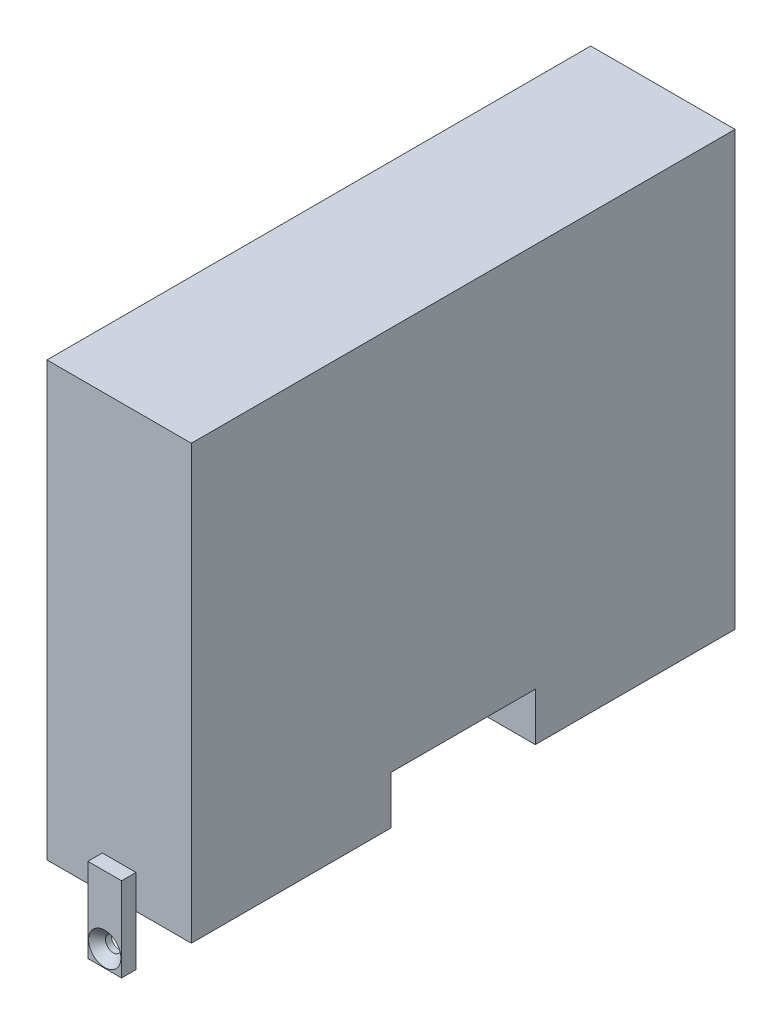
ISO-10303-21;
HEADER;
FILE_DESCRIPTION(('STEP AP214'),'2;1');
FILE_NAME('part.step','',(''),(''),'','','');
FILE_SCHEMA(('AUTOMOTIVE_DESIGN { 1 0 10303 214 1 1 1 1 }'));
ENDSEC;
DATA;
#1=APPLICATION_CONTEXT('core data for automotive mechanical design processes');
#2=APPLICATION_PROTOCOL_DEFINITION('international standard','automotive_design',2000,#1);
#3=PRODUCT_CONTEXT('',#1,'mechanical');
#4=PRODUCT('Part','Part','',(#3));
#5=PRODUCT_RELATED_PRODUCT_CATEGORY('part','',(#4));
#6=PRODUCT_DEFINITION_FORMATION('','',#4);
#7=PRODUCT_DEFINITION_CONTEXT('part definition',#1,'design');
#8=PRODUCT_DEFINITION('design','',#6,#7);
#9=PRODUCT_DEFINITION_SHAPE('','',#8);
#10=(LENGTH_UNIT() NAMED_UNIT(*) SI_UNIT(.MILLI.,.METRE.));
#11=(NAMED_UNIT(*) PLANE_ANGLE_UNIT() SI_UNIT($,.RADIAN.));
#12=(NAMED_UNIT(*) SI_UNIT($,.STERADIAN.) SOLID_ANGLE_UNIT());
#13=UNCERTAINTY_MEASURE_WITH_UNIT(LENGTH_MEASURE(1.E-05),#10,'distance_accuracy_value','');
#14=(GEOMETRIC_REPRESENTATION_CONTEXT(3) GLOBAL_UNCERTAINTY_ASSIGNED_CONTEXT((#13)) GLOBAL_UNIT_ASSIGNED_CONTEXT((#10,
#11,#12)) REPRESENTATION_CONTEXT('',''));
#15=CARTESIAN_POINT('',(0.,0.,0.));
#16=DIRECTION('',(0.,0.,1.));
#17=DIRECTION('',(1.,0.,0.));
#18=AXIS2_PLACEMENT_3D('',#15,#16,#17);
#19=CARTESIAN_POINT('',(15.,90.,56.5));
#20=DIRECTION('',(0.,0.,-1.));
#21=DIRECTION('',(-1.,0.,0.));
#22=AXIS2_PLACEMENT_3D('',#19,#20,#21);
#23=PLANE('',#22);
#24=DIRECTION('',(0.,-1.,0.));
#25=VECTOR('',#24,1.);
#26=CARTESIAN_POINT('',(-3.50000000000003,7.,56.5));
#27=LINE('',#26,#25);
#28=CARTESIAN_POINT('',(-3.50000000000003,7.,56.5));
#29=VERTEX_POINT('',#28);
#30=CARTESIAN_POINT('',(-3.50000000000003,0.,56.5));
#31=VERTEX_POINT('',#30);
#32=EDGE_CURVE('E51',#29,#31,#27,.T.);
#33=ORIENTED_EDGE('',*,*,#32,.F.);
#34=DIRECTION('',(-1.,0.,0.));
#35=VECTOR('',#34,1.);
#36=CARTESIAN_POINT('',(3.50000000000002,7.,56.5));
#37=LINE('',#36,#35);
#38=CARTESIAN_POINT('',(3.50000000000002,7.,56.5));
#39=VERTEX_POINT('',#38);
#40=EDGE_CURVE('E208',#39,#29,#37,.T.);
#41=ORIENTED_EDGE('',*,*,#40,.F.);
#42=DIRECTION('',(0.,1.,0.));
#43=VECTOR('',#42,1.);
#44=CARTESIAN_POINT('',(3.50000000000002,7.,56.5));
#45=LINE('',#44,#43);
#46=CARTESIAN_POINT('',(3.50000000000003,0.,56.5));
#47=VERTEX_POINT('',#46);
#48=EDGE_CURVE('E11',#47,#39,#45,.T.);
#49=ORIENTED_EDGE('',*,*,#48,.F.);
#50=DIRECTION('',(1.,0.,0.));
#51=VECTOR('',#50,1.);
#52=CARTESIAN_POINT('',(15.,0.,56.5));
#53=LINE('',#52,#51);
#54=CARTESIAN_POINT('',(15.,0.,56.5));
#55=VERTEX_POINT('',#54);
#56=EDGE_CURVE('E339',#47,#55,#53,.T.);
#57=ORIENTED_EDGE('',*,*,#56,.T.);
#58=DIRECTION('',(0.,-1.,0.));
#59=VECTOR('',#58,1.);
#60=CARTESIAN_POINT('',(15.,90.,56.5));
#61=LINE('',#60,#59);
#62=CARTESIAN_POINT('',(15.,90.,56.5));
#63=VERTEX_POINT('',#62);
#64=EDGE_CURVE('E356',#63,#55,#61,.T.);
#65=ORIENTED_EDGE('',*,*,#64,.F.);
#66=DIRECTION('',(1.,0.,0.));
#67=VECTOR('',#66,1.);
#68=CARTESIAN_POINT('',(15.,90.,56.5));
#69=LINE('',#68,#67);
#70=CARTESIAN_POINT('',(-15.,90.,56.5));
#71=VERTEX_POINT('',#70);
#72=EDGE_CURVE('E329',#71,#63,#69,.T.);
#73=ORIENTED_EDGE('',*,*,#72,.F.);
#74=DIRECTION('',(0.,-1.,0.));
#75=VECTOR('',#74,1.);
#76=CARTESIAN_POINT('',(-15.,90.,56.5));
#77=LINE('',#76,#75);
#78=CARTESIAN_POINT('',(-15.,0.,56.5));
#79=VERTEX_POINT('',#78);
#80=EDGE_CURVE('E359',#71,#79,#77,.T.);
#81=ORIENTED_EDGE('',*,*,#80,.T.);
#82=EDGE_CURVE('E340',#79,#31,#53,.T.);
#83=ORIENTED_EDGE('',*,*,#82,.T.);
#84=EDGE_LOOP('',(#33,#41,#49,#57,#65,#73,#81,#83));
#85=FACE_BOUND('',#84,.T.);
#86=ADVANCED_FACE('F33',(#85),#23,.F.);
#87=CARTESIAN_POINT('',(15.,90.,-56.5));
#88=DIRECTION('',(0.,0.,1.));
#89=DIRECTION('',(1.,0.,0.));
#90=AXIS2_PLACEMENT_3D('',#87,#88,#89);
#91=PLANE('',#90);
#92=DIRECTION('',(0.,-1.,0.));
#93=VECTOR('',#92,1.);
#94=CARTESIAN_POINT('',(3.49999999999997,6.75,-56.5));
#95=LINE('',#94,#93);
#96=CARTESIAN_POINT('',(3.49999999999997,6.75,-56.5));
#97=VERTEX_POINT('',#96);
#98=CARTESIAN_POINT('',(3.49999999999997,0.,-56.5));
#99=VERTEX_POINT('',#98);
#100=EDGE_CURVE('E237',#97,#99,#95,.T.);
#101=ORIENTED_EDGE('',*,*,#100,.F.);
#102=DIRECTION('',(1.,0.,0.));
#103=VECTOR('',#102,1.);
#104=CARTESIAN_POINT('',(-3.50000000000003,6.75,-56.5));
#105=LINE('',#104,#103);
#106=CARTESIAN_POINT('',(-3.50000000000003,6.75,-56.5));
#107=VERTEX_POINT('',#106);
#108=EDGE_CURVE('E230',#107,#97,#105,.T.);
#109=ORIENTED_EDGE('',*,*,#108,.F.);
#110=DIRECTION('',(0.,1.,0.));
#111=VECTOR('',#110,1.);
#112=CARTESIAN_POINT('',(-3.50000000000003,6.75,-56.5));
#113=LINE('',#112,#111);
#114=CARTESIAN_POINT('',(-3.50000000000003,0.,-56.5));
#115=VERTEX_POINT('',#114);
#116=EDGE_CURVE('E42',#115,#107,#113,.T.);
#117=ORIENTED_EDGE('',*,*,#116,.F.);
#118=DIRECTION('',(-1.,0.,0.));
#119=VECTOR('',#118,1.);
#120=CARTESIAN_POINT('',(15.,0.,-56.5));
#121=LINE('',#120,#119);
#122=CARTESIAN_POINT('',(-15.,0.,-56.5));
#123=VERTEX_POINT('',#122);
#124=EDGE_CURVE('E347',#115,#123,#121,.T.);
#125=ORIENTED_EDGE('',*,*,#124,.T.);
#126=DIRECTION('',(0.,-1.,0.));
#127=VECTOR('',#126,1.);
#128=CARTESIAN_POINT('',(-15.,90.,-56.5));
#129=LINE('',#128,#127);
#130=CARTESIAN_POINT('',(-15.,90.,-56.5));
#131=VERTEX_POINT('',#130);
#132=EDGE_CURVE('E336',#131,#123,#129,.T.);
#133=ORIENTED_EDGE('',*,*,#132,.F.);
#134=DIRECTION('',(-1.,0.,0.));
#135=VECTOR('',#134,1.);
#136=CARTESIAN_POINT('',(15.,90.,-56.5));
#137=LINE('',#136,#135);
#138=CARTESIAN_POINT('',(15.,90.,-56.5));
#139=VERTEX_POINT('',#138);
#140=EDGE_CURVE('E334',#139,#131,#137,.T.);
#141=ORIENTED_EDGE('',*,*,#140,.F.);
#142=DIRECTION('',(0.,-1.,0.));
#143=VECTOR('',#142,1.);
#144=CARTESIAN_POINT('',(15.,90.,-56.5));
#145=LINE('',#144,#143);
#146=CARTESIAN_POINT('',(15.,0.,-56.5));
#147=VERTEX_POINT('',#146);
#148=EDGE_CURVE('E353',#139,#147,#145,.T.);
#149=ORIENTED_EDGE('',*,*,#148,.T.);
#150=EDGE_CURVE('E330',#147,#99,#121,.T.);
#151=ORIENTED_EDGE('',*,*,#150,.T.);
#152=EDGE_LOOP('',(#101,#109,#117,#125,#133,#141,#149,#151));
#153=FACE_BOUND('',#152,.T.);
#154=ADVANCED_FACE('F398',(#153),#91,.F.);
#155=CARTESIAN_POINT('',(-15.,90.,-56.5));
#156=DIRECTION('',(1.,0.,0.));
#157=DIRECTION('',(0.,0.,-1.));
#158=AXIS2_PLACEMENT_3D('',#155,#156,#157);
#159=PLANE('',#158);
#160=DIRECTION('',(0.,-1.,0.));
#161=VECTOR('',#160,1.);
#162=CARTESIAN_POINT('',(-15.,90.,-47.5));
#163=LINE('',#162,#161);
#164=CARTESIAN_POINT('',(-15.,85.,-47.5));
#165=VERTEX_POINT('',#164);
#166=CARTESIAN_POINT('',(-15.,39.77,-47.5));
#167=VERTEX_POINT('',#166);
#168=EDGE_CURVE('E368',#165,#167,#163,.T.);
#169=ORIENTED_EDGE('',*,*,#168,.F.);
#170=DIRECTION('',(0.,0.,1.));
#171=VECTOR('',#170,1.);
#172=CARTESIAN_POINT('',(-15.,85.,-56.5));
#173=LINE('',#172,#171);
#174=CARTESIAN_POINT('',(-15.,85.,47.5));
#175=VERTEX_POINT('',#174);
#176=EDGE_CURVE('E370',#165,#175,#173,.T.);
#177=ORIENTED_EDGE('',*,*,#176,.T.);
#178=DIRECTION('',(0.,-1.,0.));
#179=VECTOR('',#178,1.);
#180=CARTESIAN_POINT('',(-15.,90.,47.5));
#181=LINE('',#180,#179);
#182=CARTESIAN_POINT('',(-15.,39.77,47.5));
#183=VERTEX_POINT('',#182);
#184=EDGE_CURVE('E362',#175,#183,#181,.T.);
#185=ORIENTED_EDGE('',*,*,#184,.T.);
#186=DIRECTION('',(0.,0.,1.));
#187=VECTOR('',#186,1.);
#188=CARTESIAN_POINT('',(-15.,39.77,-56.5));
#189=LINE('',#188,#187);
#190=EDGE_CURVE('E365',#167,#183,#189,.T.);
#191=ORIENTED_EDGE('',*,*,#190,.F.);
#192=EDGE_LOOP('',(#169,#177,#185,#191));
#193=FACE_BOUND('',#192,.T.);
#194=DIRECTION('',(0.,0.,1.));
#195=VECTOR('',#194,1.);
#196=CARTESIAN_POINT('',(-15.,0.,-56.5));
#197=LINE('',#196,#195);
#198=EDGE_CURVE('E320',#123,#79,#197,.T.);
#199=ORIENTED_EDGE('',*,*,#198,.T.);
#200=ORIENTED_EDGE('',*,*,#80,.F.);
#201=DIRECTION('',(0.,0.,1.));
#202=VECTOR('',#201,1.);
#203=CARTESIAN_POINT('',(-15.,90.,-56.5));
#204=LINE('',#203,#202);
#205=EDGE_CURVE('E326',#131,#71,#204,.T.);
#206=ORIENTED_EDGE('',*,*,#205,.F.);
#207=ORIENTED_EDGE('',*,*,#132,.T.);
#208=EDGE_LOOP('',(#199,#200,#206,#207));
#209=FACE_BOUND('',#208,.T.);
#210=ADVANCED_FACE('F35',(#193,#209),#159,.F.);
#211=CARTESIAN_POINT('',(15.,90.,-56.5));
#212=DIRECTION('',(-1.,0.,0.));
#213=DIRECTION('',(0.,0.,1.));
#214=AXIS2_PLACEMENT_3D('',#211,#212,#213);
#215=PLANE('',#214);
#216=DIRECTION('',(0.,0.,-1.));
#217=VECTOR('',#216,1.);
#218=CARTESIAN_POINT('',(15.,0.,-56.5));
#219=LINE('',#218,#217);
#220=CARTESIAN_POINT('',(15.,0.,15.));
#221=VERTEX_POINT('',#220);
#222=EDGE_CURVE('E344',#55,#221,#219,.T.);
#223=ORIENTED_EDGE('',*,*,#222,.T.);
#224=DIRECTION('',(0.,-1.,0.));
#225=VECTOR('',#224,1.);
#226=CARTESIAN_POINT('',(15.,0.,15.));
#227=LINE('',#226,#225);
#228=CARTESIAN_POINT('',(15.,10.,15.));
#229=VERTEX_POINT('',#228);
#230=EDGE_CURVE('E277',#229,#221,#227,.T.);
#231=ORIENTED_EDGE('',*,*,#230,.F.);
#232=DIRECTION('',(0.,0.,1.));
#233=VECTOR('',#232,1.);
#234=CARTESIAN_POINT('',(15.,10.,15.));
#235=LINE('',#234,#233);
#236=CARTESIAN_POINT('',(15.,10.,-15.));
#237=VERTEX_POINT('',#236);
#238=EDGE_CURVE('E281',#237,#229,#235,.T.);
#239=ORIENTED_EDGE('',*,*,#238,.F.);
#240=DIRECTION('',(0.,1.,0.));
#241=VECTOR('',#240,1.);
#242=CARTESIAN_POINT('',(15.,0.,-15.));
#243=LINE('',#242,#241);
#244=CARTESIAN_POINT('',(15.,0.,-15.));
#245=VERTEX_POINT('',#244);
#246=EDGE_CURVE('E292',#245,#237,#243,.T.);
#247=ORIENTED_EDGE('',*,*,#246,.F.);
#248=EDGE_CURVE('E342',#245,#147,#219,.T.);
#249=ORIENTED_EDGE('',*,*,#248,.T.);
#250=ORIENTED_EDGE('',*,*,#148,.F.);
#251=DIRECTION('',(0.,0.,-1.));
#252=VECTOR('',#251,1.);
#253=CARTESIAN_POINT('',(15.,90.,-56.5));
#254=LINE('',#253,#252);
#255=EDGE_CURVE('E332',#63,#139,#254,.T.);
#256=ORIENTED_EDGE('',*,*,#255,.F.);
#257=ORIENTED_EDGE('',*,*,#64,.T.);
#258=EDGE_LOOP('',(#223,#231,#239,#247,#249,#250,#256,#257));
#259=FACE_BOUND('',#258,.T.);
#260=ADVANCED_FACE('F416',(#259),#215,.F.);
#261=CARTESIAN_POINT('',(0.,90.,0.));
#262=DIRECTION('',(0.,-1.,0.));
#263=DIRECTION('',(0.,0.,-1.));
#264=AXIS2_PLACEMENT_3D('',#261,#262,#263);
#265=PLANE('',#264);
#266=ORIENTED_EDGE('',*,*,#205,.T.);
#267=ORIENTED_EDGE('',*,*,#72,.T.);
#268=ORIENTED_EDGE('',*,*,#255,.T.);
#269=ORIENTED_EDGE('',*,*,#140,.T.);
#270=EDGE_LOOP('',(#266,#267,#268,#269));
#271=FACE_BOUND('',#270,.T.);
#272=ADVANCED_FACE('F418',(#271),#265,.F.);
#273=CARTESIAN_POINT('',(0.,0.,0.));
#274=DIRECTION('',(0.,-1.,0.));
#275=DIRECTION('',(0.,0.,-1.));
#276=AXIS2_PLACEMENT_3D('',#273,#274,#275);
#277=PLANE('',#276);
#278=DIRECTION('',(1.,0.,0.));
#279=VECTOR('',#278,1.);
#280=CARTESIAN_POINT('',(5.,0.,15.));
#281=LINE('',#280,#279);
#282=CARTESIAN_POINT('',(5.,0.,15.));
#283=VERTEX_POINT('',#282);
#284=EDGE_CURVE('E290',#283,#221,#281,.T.);
#285=ORIENTED_EDGE('',*,*,#284,.T.);
#286=ORIENTED_EDGE('',*,*,#222,.F.);
#287=ORIENTED_EDGE('',*,*,#56,.F.);
#288=EDGE_CURVE('E343',#31,#47,#53,.T.);
#289=ORIENTED_EDGE('',*,*,#288,.F.);
#290=ORIENTED_EDGE('',*,*,#82,.F.);
#291=ORIENTED_EDGE('',*,*,#198,.F.);
#292=ORIENTED_EDGE('',*,*,#124,.F.);
#293=EDGE_CURVE('E350',#99,#115,#121,.T.);
#294=ORIENTED_EDGE('',*,*,#293,.F.);
#295=ORIENTED_EDGE('',*,*,#150,.F.);
#296=ORIENTED_EDGE('',*,*,#248,.F.);
#297=DIRECTION('',(1.,0.,0.));
#298=VECTOR('',#297,1.);
#299=CARTESIAN_POINT('',(5.,0.,-15.));
#300=LINE('',#299,#298);
#301=CARTESIAN_POINT('',(5.,0.,-15.));
#302=VERTEX_POINT('',#301);
#303=EDGE_CURVE('E302',#302,#245,#300,.T.);
#304=ORIENTED_EDGE('',*,*,#303,.F.);
#305=DIRECTION('',(0.,0.,-1.));
#306=VECTOR('',#305,1.);
#307=CARTESIAN_POINT('',(5.,0.,15.));
#308=LINE('',#307,#306);
#309=EDGE_CURVE('E280',#283,#302,#308,.T.);
#310=ORIENTED_EDGE('',*,*,#309,.F.);
#311=EDGE_LOOP('',(#285,#286,#287,#289,#290,#291,#292,#294,#295,#296,#304,#310));
#312=FACE_BOUND('',#311,.T.);
#313=ADVANCED_FACE('F421',(#312),#277,.T.);
#314=CARTESIAN_POINT('',(-90.,85.,-47.5));
#315=DIRECTION('',(0.,1.,0.));
#316=DIRECTION('',(0.,0.,1.));
#317=AXIS2_PLACEMENT_3D('',#314,#315,#316);
#318=PLANE('',#317);
#319=DIRECTION('',(1.,0.,0.));
#320=VECTOR('',#319,1.);
#321=CARTESIAN_POINT('',(-90.,85.,-47.5));
#322=LINE('',#321,#320);
#323=CARTESIAN_POINT('',(0.,85.,-47.5));
#324=VERTEX_POINT('',#323);
#325=EDGE_CURVE('E318',#165,#324,#322,.T.);
#326=ORIENTED_EDGE('',*,*,#325,.T.);
#327=DIRECTION('',(0.,0.,1.));
#328=VECTOR('',#327,1.);
#329=CARTESIAN_POINT('',(0.,85.,-47.5));
#330=LINE('',#329,#328);
#331=CARTESIAN_POINT('',(0.,85.,47.5));
#332=VERTEX_POINT('',#331);
#333=EDGE_CURVE('E299',#324,#332,#330,.T.);
#334=ORIENTED_EDGE('',*,*,#333,.T.);
#335=DIRECTION('',(1.,0.,0.));
#336=VECTOR('',#335,1.);
#337=CARTESIAN_POINT('',(-90.,85.,47.5));
#338=LINE('',#337,#336);
#339=EDGE_CURVE('E317',#175,#332,#338,.T.);
#340=ORIENTED_EDGE('',*,*,#339,.F.);
#341=ORIENTED_EDGE('',*,*,#176,.F.);
#342=EDGE_LOOP('',(#326,#334,#340,#341));
#343=FACE_BOUND('',#342,.T.);
#344=ADVANCED_FACE('F424',(#343),#318,.F.);
#345=CARTESIAN_POINT('',(-90.,85.,-47.5));
#346=DIRECTION('',(0.,0.,1.));
#347=DIRECTION('',(0.,-1.,0.));
#348=AXIS2_PLACEMENT_3D('',#345,#346,#347);
#349=PLANE('',#348);
#350=ORIENTED_EDGE('',*,*,#168,.T.);
#351=DIRECTION('',(1.,0.,0.));
#352=VECTOR('',#351,1.);
#353=CARTESIAN_POINT('',(-90.,39.77,-47.5));
#354=LINE('',#353,#352);
#355=CARTESIAN_POINT('',(0.,39.77,-47.5));
#356=VERTEX_POINT('',#355);
#357=EDGE_CURVE('E321',#167,#356,#354,.T.);
#358=ORIENTED_EDGE('',*,*,#357,.T.);
#359=DIRECTION('',(0.,-1.,0.));
#360=VECTOR('',#359,1.);
#361=CARTESIAN_POINT('',(0.,85.,-47.5));
#362=LINE('',#361,#360);
#363=EDGE_CURVE('E314',#324,#356,#362,.T.);
#364=ORIENTED_EDGE('',*,*,#363,.F.);
#365=ORIENTED_EDGE('',*,*,#325,.F.);
#366=EDGE_LOOP('',(#350,#358,#364,#365));
#367=FACE_BOUND('',#366,.T.);
#368=ADVANCED_FACE('F431',(#367),#349,.T.);
#369=CARTESIAN_POINT('',(-90.,39.77,-47.5));
#370=DIRECTION('',(0.,1.,0.));
#371=DIRECTION('',(0.,0.,1.));
#372=AXIS2_PLACEMENT_3D('',#369,#370,#371);
#373=PLANE('',#372);
#374=CARTESIAN_POINT('',(-8.50000000000001,39.77,-23.38));
#375=DIRECTION('',(0.,1.,0.));
#376=DIRECTION('',(0.,0.,1.));
#377=AXIS2_PLACEMENT_3D('',#374,#375,#376);
#378=CIRCLE('',#377,2.525);
#379=CARTESIAN_POINT('',(-8.50000000000001,39.77,-20.855));
#380=VERTEX_POINT('',#379);
#381=EDGE_CURVE('E259',#380,#380,#378,.T.);
#382=ORIENTED_EDGE('',*,*,#381,.F.);
#383=EDGE_LOOP('',(#382));
#384=FACE_BOUND('',#383,.T.);
#385=CARTESIAN_POINT('',(-8.50000000000002,39.77,18.62));
#386=DIRECTION('',(0.,1.,0.));
#387=DIRECTION('',(0.,0.,1.));
#388=AXIS2_PLACEMENT_3D('',#385,#386,#387);
#389=CIRCLE('',#388,2.525);
#390=CARTESIAN_POINT('',(-8.50000000000002,39.77,21.145));
#391=VERTEX_POINT('',#390);
#392=EDGE_CURVE('E268',#391,#391,#389,.T.);
#393=ORIENTED_EDGE('',*,*,#392,.F.);
#394=EDGE_LOOP('',(#393));
#395=FACE_BOUND('',#394,.T.);
#396=ORIENTED_EDGE('',*,*,#190,.T.);
#397=DIRECTION('',(1.,0.,0.));
#398=VECTOR('',#397,1.);
#399=CARTESIAN_POINT('',(-90.,39.77,47.5));
#400=LINE('',#399,#398);
#401=CARTESIAN_POINT('',(0.,39.77,47.5));
#402=VERTEX_POINT('',#401);
#403=EDGE_CURVE('E323',#183,#402,#400,.T.);
#404=ORIENTED_EDGE('',*,*,#403,.T.);
#405=DIRECTION('',(0.,0.,1.));
#406=VECTOR('',#405,1.);
#407=CARTESIAN_POINT('',(0.,39.77,-47.5));
#408=LINE('',#407,#406);
#409=EDGE_CURVE('E311',#356,#402,#408,.T.);
#410=ORIENTED_EDGE('',*,*,#409,.F.);
#411=ORIENTED_EDGE('',*,*,#357,.F.);
#412=EDGE_LOOP('',(#396,#404,#410,#411));
#413=FACE_BOUND('',#412,.T.);
#414=ADVANCED_FACE('F437',(#384,#395,#413),#373,.T.);
#415=CARTESIAN_POINT('',(-90.,85.,47.5));
#416=DIRECTION('',(0.,0.,1.));
#417=DIRECTION('',(0.,-1.,0.));
#418=AXIS2_PLACEMENT_3D('',#415,#416,#417);
#419=PLANE('',#418);
#420=ORIENTED_EDGE('',*,*,#339,.T.);
#421=DIRECTION('',(0.,-1.,0.));
#422=VECTOR('',#421,1.);
#423=CARTESIAN_POINT('',(0.,85.,47.5));
#424=LINE('',#423,#422);
#425=EDGE_CURVE('E308',#332,#402,#424,.T.);
#426=ORIENTED_EDGE('',*,*,#425,.T.);
#427=ORIENTED_EDGE('',*,*,#403,.F.);
#428=ORIENTED_EDGE('',*,*,#184,.F.);
#429=EDGE_LOOP('',(#420,#426,#427,#428));
#430=FACE_BOUND('',#429,.T.);
#431=ADVANCED_FACE('F433',(#430),#419,.F.);
#432=CARTESIAN_POINT('',(0.,0.,0.));
#433=DIRECTION('',(1.,0.,0.));
#434=DIRECTION('',(0.,0.,-1.));
#435=AXIS2_PLACEMENT_3D('',#432,#433,#434);
#436=PLANE('',#435);
#437=ORIENTED_EDGE('',*,*,#333,.F.);
#438=ORIENTED_EDGE('',*,*,#363,.T.);
#439=ORIENTED_EDGE('',*,*,#409,.T.);
#440=ORIENTED_EDGE('',*,*,#425,.F.);
#441=EDGE_LOOP('',(#437,#438,#439,#440));
#442=FACE_BOUND('',#441,.T.);
#443=ADVANCED_FACE('F436',(#442),#436,.F.);
#444=CARTESIAN_POINT('',(5.,0.,15.));
#445=DIRECTION('',(0.,0.,1.));
#446=DIRECTION('',(1.,0.,0.));
#447=AXIS2_PLACEMENT_3D('',#444,#445,#446);
#448=PLANE('',#447);
#449=ORIENTED_EDGE('',*,*,#230,.T.);
#450=ORIENTED_EDGE('',*,*,#284,.F.);
#451=DIRECTION('',(0.,-1.,0.));
#452=VECTOR('',#451,1.);
#453=CARTESIAN_POINT('',(5.,0.,15.));
#454=LINE('',#453,#452);
#455=CARTESIAN_POINT('',(5.,10.,15.));
#456=VERTEX_POINT('',#455);
#457=EDGE_CURVE('E278',#456,#283,#454,.T.);
#458=ORIENTED_EDGE('',*,*,#457,.F.);
#459=DIRECTION('',(1.,0.,0.));
#460=VECTOR('',#459,1.);
#461=CARTESIAN_POINT('',(5.,10.,15.));
#462=LINE('',#461,#460);
#463=EDGE_CURVE('E297',#456,#229,#462,.T.);
#464=ORIENTED_EDGE('',*,*,#463,.T.);
#465=EDGE_LOOP('',(#449,#450,#458,#464));
#466=FACE_BOUND('',#465,.T.);
#467=ADVANCED_FACE('F447',(#466),#448,.F.);
#468=CARTESIAN_POINT('',(5.,10.,15.));
#469=DIRECTION('',(0.,1.,0.));
#470=DIRECTION('',(0.,0.,1.));
#471=AXIS2_PLACEMENT_3D('',#468,#469,#470);
#472=PLANE('',#471);
#473=ORIENTED_EDGE('',*,*,#238,.T.);
#474=ORIENTED_EDGE('',*,*,#463,.F.);
#475=DIRECTION('',(0.,0.,1.));
#476=VECTOR('',#475,1.);
#477=CARTESIAN_POINT('',(5.,10.,15.));
#478=LINE('',#477,#476);
#479=CARTESIAN_POINT('',(5.,10.,-15.));
#480=VERTEX_POINT('',#479);
#481=EDGE_CURVE('E287',#480,#456,#478,.T.);
#482=ORIENTED_EDGE('',*,*,#481,.F.);
#483=DIRECTION('',(1.,0.,0.));
#484=VECTOR('',#483,1.);
#485=CARTESIAN_POINT('',(5.,10.,-15.));
#486=LINE('',#485,#484);
#487=EDGE_CURVE('E300',#480,#237,#486,.T.);
#488=ORIENTED_EDGE('',*,*,#487,.T.);
#489=EDGE_LOOP('',(#473,#474,#482,#488));
#490=FACE_BOUND('',#489,.T.);
#491=ADVANCED_FACE('F451',(#490),#472,.F.);
#492=CARTESIAN_POINT('',(5.,0.,-15.));
#493=DIRECTION('',(0.,0.,-1.));
#494=DIRECTION('',(-1.,0.,0.));
#495=AXIS2_PLACEMENT_3D('',#492,#493,#494);
#496=PLANE('',#495);
#497=ORIENTED_EDGE('',*,*,#246,.T.);
#498=ORIENTED_EDGE('',*,*,#487,.F.);
#499=DIRECTION('',(0.,1.,0.));
#500=VECTOR('',#499,1.);
#501=CARTESIAN_POINT('',(5.,0.,-15.));
#502=LINE('',#501,#500);
#503=EDGE_CURVE('E284',#302,#480,#502,.T.);
#504=ORIENTED_EDGE('',*,*,#503,.F.);
#505=ORIENTED_EDGE('',*,*,#303,.T.);
#506=EDGE_LOOP('',(#497,#498,#504,#505));
#507=FACE_BOUND('',#506,.T.);
#508=ADVANCED_FACE('F453',(#507),#496,.F.);
#509=CARTESIAN_POINT('',(5.,0.,0.));
#510=DIRECTION('',(-1.,0.,0.));
#511=DIRECTION('',(0.,0.,1.));
#512=AXIS2_PLACEMENT_3D('',#509,#510,#511);
#513=PLANE('',#512);
#514=ORIENTED_EDGE('',*,*,#457,.T.);
#515=ORIENTED_EDGE('',*,*,#309,.T.);
#516=ORIENTED_EDGE('',*,*,#503,.T.);
#517=ORIENTED_EDGE('',*,*,#481,.T.);
#518=EDGE_LOOP('',(#514,#515,#516,#517));
#519=FACE_BOUND('',#518,.T.);
#520=ADVANCED_FACE('F456',(#519),#513,.F.);
#521=CARTESIAN_POINT('',(-8.50000000000002,33.2721515475689,18.62));
#522=DIRECTION('',(0.,1.,0.));
#523=DIRECTION('',(0.,0.,1.));
#524=AXIS2_PLACEMENT_3D('',#521,#522,#523);
#525=CONICAL_SURFACE('',#524,2.5,1.02974425867665);
#526=CARTESIAN_POINT('',(-8.50000000000002,31.77,18.62));
#527=VERTEX_POINT('',#526);
#528=VERTEX_LOOP('',#527);
#529=FACE_BOUND('',#528,.T.);
#530=CARTESIAN_POINT('',(-8.50000000000002,33.2721515475689,18.62));
#531=DIRECTION('',(0.,1.,0.));
#532=DIRECTION('',(0.,0.,1.));
#533=AXIS2_PLACEMENT_3D('',#530,#531,#532);
#534=CIRCLE('',#533,2.5);
#535=CARTESIAN_POINT('',(-8.50000000000002,33.2721515475689,21.12));
#536=VERTEX_POINT('',#535);
#537=EDGE_CURVE('E274',#536,#536,#534,.T.);
#538=ORIENTED_EDGE('',*,*,#537,.T.);
#539=EDGE_LOOP('',(#538));
#540=FACE_BOUND('',#539,.T.);
#541=ADVANCED_FACE('F463',(#529,#540),#525,.F.);
#542=CARTESIAN_POINT('',(-8.50000000000002,39.77,18.62));
#543=DIRECTION('',(0.,1.,0.));
#544=DIRECTION('',(0.,0.,1.));
#545=AXIS2_PLACEMENT_3D('',#542,#543,#544);
#546=CYLINDRICAL_SURFACE('',#545,2.5);
#547=ORIENTED_EDGE('',*,*,#537,.F.);
#548=EDGE_LOOP('',(#547));
#549=FACE_BOUND('',#548,.T.);
#550=CARTESIAN_POINT('',(-8.50000000000002,39.745,18.62));
#551=DIRECTION('',(0.,1.,0.));
#552=DIRECTION('',(0.,0.,1.));
#553=AXIS2_PLACEMENT_3D('',#550,#551,#552);
#554=CIRCLE('',#553,2.5);
#555=CARTESIAN_POINT('',(-8.50000000000002,39.745,21.12));
#556=VERTEX_POINT('',#555);
#557=EDGE_CURVE('E271',#556,#556,#554,.T.);
#558=ORIENTED_EDGE('',*,*,#557,.T.);
#559=EDGE_LOOP('',(#558));
#560=FACE_BOUND('',#559,.T.);
#561=ADVANCED_FACE('F467',(#549,#560),#546,.F.);
#562=CARTESIAN_POINT('',(-8.50000000000002,39.77,18.62));
#563=DIRECTION('',(0.,1.,0.));
#564=DIRECTION('',(0.,0.,1.));
#565=AXIS2_PLACEMENT_3D('',#562,#563,#564);
#566=CONICAL_SURFACE('',#565,2.525,0.785398163397362);
#567=ORIENTED_EDGE('',*,*,#557,.F.);
#568=EDGE_LOOP('',(#567));
#569=FACE_BOUND('',#568,.T.);
#570=ORIENTED_EDGE('',*,*,#392,.T.);
#571=EDGE_LOOP('',(#570));
#572=FACE_BOUND('',#571,.T.);
#573=ADVANCED_FACE('F471',(#569,#572),#566,.F.);
#574=CARTESIAN_POINT('',(-8.50000000000001,33.2721515475689,-23.38));
#575=DIRECTION('',(0.,1.,0.));
#576=DIRECTION('',(0.,0.,1.));
#577=AXIS2_PLACEMENT_3D('',#574,#575,#576);
#578=CONICAL_SURFACE('',#577,2.5,1.02974425867665);
#579=CARTESIAN_POINT('',(-8.50000000000001,31.77,-23.38));
#580=VERTEX_POINT('',#579);
#581=VERTEX_LOOP('',#580);
#582=FACE_BOUND('',#581,.T.);
#583=CARTESIAN_POINT('',(-8.50000000000001,33.2721515475689,-23.38));
#584=DIRECTION('',(0.,1.,0.));
#585=DIRECTION('',(0.,0.,1.));
#586=AXIS2_PLACEMENT_3D('',#583,#584,#585);
#587=CIRCLE('',#586,2.5);
#588=CARTESIAN_POINT('',(-8.50000000000001,33.2721515475689,-20.88));
#589=VERTEX_POINT('',#588);
#590=EDGE_CURVE('E265',#589,#589,#587,.T.);
#591=ORIENTED_EDGE('',*,*,#590,.T.);
#592=EDGE_LOOP('',(#591));
#593=FACE_BOUND('',#592,.T.);
#594=ADVANCED_FACE('F475',(#582,#593),#578,.F.);
#595=CARTESIAN_POINT('',(-8.50000000000001,39.77,-23.38));
#596=DIRECTION('',(0.,1.,0.));
#597=DIRECTION('',(0.,0.,1.));
#598=AXIS2_PLACEMENT_3D('',#595,#596,#597);
#599=CYLINDRICAL_SURFACE('',#598,2.5);
#600=ORIENTED_EDGE('',*,*,#590,.F.);
#601=EDGE_LOOP('',(#600));
#602=FACE_BOUND('',#601,.T.);
#603=CARTESIAN_POINT('',(-8.50000000000001,39.745,-23.38));
#604=DIRECTION('',(0.,1.,0.));
#605=DIRECTION('',(0.,0.,1.));
#606=AXIS2_PLACEMENT_3D('',#603,#604,#605);
#607=CIRCLE('',#606,2.5);
#608=CARTESIAN_POINT('',(-8.50000000000001,39.745,-20.88));
#609=VERTEX_POINT('',#608);
#610=EDGE_CURVE('E262',#609,#609,#607,.T.);
#611=ORIENTED_EDGE('',*,*,#610,.T.);
#612=EDGE_LOOP('',(#611));
#613=FACE_BOUND('',#612,.T.);
#614=ADVANCED_FACE('F479',(#602,#613),#599,.F.);
#615=CARTESIAN_POINT('',(-8.50000000000001,39.77,-23.38));
#616=DIRECTION('',(0.,1.,0.));
#617=DIRECTION('',(0.,0.,1.));
#618=AXIS2_PLACEMENT_3D('',#615,#616,#617);
#619=CONICAL_SURFACE('',#618,2.525,0.785398163397362);
#620=ORIENTED_EDGE('',*,*,#610,.F.);
#621=EDGE_LOOP('',(#620));
#622=FACE_BOUND('',#621,.T.);
#623=ORIENTED_EDGE('',*,*,#381,.T.);
#624=EDGE_LOOP('',(#623));
#625=FACE_BOUND('',#624,.T.);
#626=ADVANCED_FACE('F483',(#622,#625),#619,.F.);
#627=CARTESIAN_POINT('',(3.49999999999997,6.75,-59.5));
#628=DIRECTION('',(-1.,0.,0.));
#629=DIRECTION('',(0.,0.,1.));
#630=AXIS2_PLACEMENT_3D('',#627,#628,#629);
#631=PLANE('',#630);
#632=ORIENTED_EDGE('',*,*,#100,.T.);
#633=CARTESIAN_POINT('',(3.49999999999997,-10.75,-56.5));
#634=VERTEX_POINT('',#633);
#635=EDGE_CURVE('E241',#99,#634,#95,.T.);
#636=ORIENTED_EDGE('',*,*,#635,.T.);
#637=DIRECTION('',(0.,0.,1.));
#638=VECTOR('',#637,1.);
#639=CARTESIAN_POINT('',(3.49999999999997,-10.75,-59.5));
#640=LINE('',#639,#638);
#641=CARTESIAN_POINT('',(3.49999999999997,-10.75,-59.5));
#642=VERTEX_POINT('',#641);
#643=EDGE_CURVE('E256',#642,#634,#640,.T.);
#644=ORIENTED_EDGE('',*,*,#643,.F.);
#645=DIRECTION('',(0.,-1.,0.));
#646=VECTOR('',#645,1.);
#647=CARTESIAN_POINT('',(3.49999999999997,6.75,-59.5));
#648=LINE('',#647,#646);
#649=CARTESIAN_POINT('',(3.49999999999997,6.75,-59.5));
#650=VERTEX_POINT('',#649);
#651=EDGE_CURVE('E226',#650,#642,#648,.T.);
#652=ORIENTED_EDGE('',*,*,#651,.F.);
#653=DIRECTION('',(0.,0.,1.));
#654=VECTOR('',#653,1.);
#655=CARTESIAN_POINT('',(3.49999999999997,6.75,-59.5));
#656=LINE('',#655,#654);
#657=EDGE_CURVE('E236',#650,#97,#656,.T.);
#658=ORIENTED_EDGE('',*,*,#657,.T.);
#659=EDGE_LOOP('',(#632,#636,#644,#652,#658));
#660=FACE_BOUND('',#659,.T.);
#661=ADVANCED_FACE('F379',(#660),#631,.F.);
#662=CARTESIAN_POINT('',(-3.50000000000003,-10.75,-59.5));
#663=DIRECTION('',(0.,1.,0.));
#664=DIRECTION('',(-1.,0.,0.));
#665=AXIS2_PLACEMENT_3D('',#662,#663,#664);
#666=PLANE('',#665);
#667=DIRECTION('',(-1.,0.,0.));
#668=VECTOR('',#667,1.);
#669=CARTESIAN_POINT('',(-3.50000000000003,-10.75,-56.5));
#670=LINE('',#669,#668);
#671=CARTESIAN_POINT('',(-3.50000000000003,-10.75,-56.5));
#672=VERTEX_POINT('',#671);
#673=EDGE_CURVE('E240',#634,#672,#670,.T.);
#674=ORIENTED_EDGE('',*,*,#673,.T.);
#675=DIRECTION('',(0.,0.,1.));
#676=VECTOR('',#675,1.);
#677=CARTESIAN_POINT('',(-3.50000000000003,-10.75,-59.5));
#678=LINE('',#677,#676);
#679=CARTESIAN_POINT('',(-3.50000000000003,-10.75,-59.5));
#680=VERTEX_POINT('',#679);
#681=EDGE_CURVE('E253',#680,#672,#678,.T.);
#682=ORIENTED_EDGE('',*,*,#681,.F.);
#683=DIRECTION('',(-1.,0.,0.));
#684=VECTOR('',#683,1.);
#685=CARTESIAN_POINT('',(-3.50000000000003,-10.75,-59.5));
#686=LINE('',#685,#684);
#687=EDGE_CURVE('E229',#642,#680,#686,.T.);
#688=ORIENTED_EDGE('',*,*,#687,.F.);
#689=ORIENTED_EDGE('',*,*,#643,.T.);
#690=EDGE_LOOP('',(#674,#682,#688,#689));
#691=FACE_BOUND('',#690,.T.);
#692=ADVANCED_FACE('F387',(#691),#666,.F.);
#693=CARTESIAN_POINT('',(-3.50000000000003,6.75,-59.5));
#694=DIRECTION('',(1.,0.,0.));
#695=DIRECTION('',(0.,0.,-1.));
#696=AXIS2_PLACEMENT_3D('',#693,#694,#695);
#697=PLANE('',#696);
#698=EDGE_CURVE('E243',#672,#115,#113,.T.);
#699=ORIENTED_EDGE('',*,*,#698,.T.);
#700=ORIENTED_EDGE('',*,*,#116,.T.);
#701=DIRECTION('',(0.,0.,1.));
#702=VECTOR('',#701,1.);
#703=CARTESIAN_POINT('',(-3.50000000000003,6.75,-59.5));
#704=LINE('',#703,#702);
#705=CARTESIAN_POINT('',(-3.50000000000003,6.75,-59.5));
#706=VERTEX_POINT('',#705);
#707=EDGE_CURVE('E250',#706,#107,#704,.T.);
#708=ORIENTED_EDGE('',*,*,#707,.F.);
#709=DIRECTION('',(0.,1.,0.));
#710=VECTOR('',#709,1.);
#711=CARTESIAN_POINT('',(-3.50000000000003,6.75,-59.5));
#712=LINE('',#711,#710);
#713=EDGE_CURVE('E232',#680,#706,#712,.T.);
#714=ORIENTED_EDGE('',*,*,#713,.F.);
#715=ORIENTED_EDGE('',*,*,#681,.T.);
#716=EDGE_LOOP('',(#699,#700,#708,#714,#715));
#717=FACE_BOUND('',#716,.T.);
#718=ADVANCED_FACE('F401',(#717),#697,.F.);
#719=CARTESIAN_POINT('',(-3.50000000000003,6.75,-59.5));
#720=DIRECTION('',(0.,-1.,0.));
#721=DIRECTION('',(1.,0.,0.));
#722=AXIS2_PLACEMENT_3D('',#719,#720,#721);
#723=PLANE('',#722);
#724=ORIENTED_EDGE('',*,*,#108,.T.);
#725=ORIENTED_EDGE('',*,*,#657,.F.);
#726=DIRECTION('',(1.,0.,0.));
#727=VECTOR('',#726,1.);
#728=CARTESIAN_POINT('',(-3.50000000000003,6.75,-59.5));
#729=LINE('',#728,#727);
#730=EDGE_CURVE('E234',#706,#650,#729,.T.);
#731=ORIENTED_EDGE('',*,*,#730,.F.);
#732=ORIENTED_EDGE('',*,*,#707,.T.);
#733=EDGE_LOOP('',(#724,#725,#731,#732));
#734=FACE_BOUND('',#733,.T.);
#735=ADVANCED_FACE('F394',(#734),#723,.F.);
#736=CARTESIAN_POINT('',(0.,0.,-59.5));
#737=DIRECTION('',(0.,0.,1.));
#738=DIRECTION('',(1.,0.,0.));
#739=AXIS2_PLACEMENT_3D('',#736,#737,#738);
#740=PLANE('',#739);
#741=CARTESIAN_POINT('',(0.,-7.25,-59.5));
#742=DIRECTION('',(0.,0.,-1.));
#743=DIRECTION('',(-1.,0.,0.));
#744=AXIS2_PLACEMENT_3D('',#741,#742,#743);
#745=CIRCLE('',#744,3.36);
#746=CARTESIAN_POINT('',(-3.36000000000003,-7.25,-59.5));
#747=VERTEX_POINT('',#746);
#748=EDGE_CURVE('E214',#747,#747,#745,.T.);
#749=ORIENTED_EDGE('',*,*,#748,.F.);
#750=EDGE_LOOP('',(#749));
#751=FACE_BOUND('',#750,.T.);
#752=ORIENTED_EDGE('',*,*,#651,.T.);
#753=ORIENTED_EDGE('',*,*,#687,.T.);
#754=ORIENTED_EDGE('',*,*,#713,.T.);
#755=ORIENTED_EDGE('',*,*,#730,.T.);
#756=EDGE_LOOP('',(#752,#753,#754,#755));
#757=FACE_BOUND('',#756,.T.);
#758=ADVANCED_FACE('F390',(#751,#757),#740,.F.);
#759=CARTESIAN_POINT('',(0.,0.,-56.5));
#760=DIRECTION('',(0.,0.,1.));
#761=DIRECTION('',(1.,0.,0.));
#762=AXIS2_PLACEMENT_3D('',#759,#760,#761);
#763=PLANE('',#762);
#764=CARTESIAN_POINT('',(0.,-7.25,-56.5));
#765=DIRECTION('',(0.,0.,1.));
#766=DIRECTION('',(1.,0.,0.));
#767=AXIS2_PLACEMENT_3D('',#764,#765,#766);
#768=CIRCLE('',#767,1.6);
#769=CARTESIAN_POINT('',(1.59999999999997,-7.25,-56.5));
#770=VERTEX_POINT('',#769);
#771=EDGE_CURVE('E225',#770,#770,#768,.T.);
#772=ORIENTED_EDGE('',*,*,#771,.F.);
#773=EDGE_LOOP('',(#772));
#774=FACE_BOUND('',#773,.T.);
#775=ORIENTED_EDGE('',*,*,#635,.F.);
#776=ORIENTED_EDGE('',*,*,#293,.T.);
#777=ORIENTED_EDGE('',*,*,#698,.F.);
#778=ORIENTED_EDGE('',*,*,#673,.F.);
#779=EDGE_LOOP('',(#775,#776,#777,#778));
#780=FACE_BOUND('',#779,.T.);
#781=ADVANCED_FACE('F384',(#774,#780),#763,.T.);
#782=CARTESIAN_POINT('',(0.,-7.25,-59.5));
#783=DIRECTION('',(0.,0.,-1.));
#784=DIRECTION('',(-1.,0.,0.));
#785=AXIS2_PLACEMENT_3D('',#782,#783,#784);
#786=CYLINDRICAL_SURFACE('',#785,1.6);
#787=ORIENTED_EDGE('',*,*,#771,.T.);
#788=EDGE_LOOP('',(#787));
#789=FACE_BOUND('',#788,.T.);
#790=CARTESIAN_POINT('',(0.,-7.25,-57.74));
#791=DIRECTION('',(0.,0.,-1.));
#792=DIRECTION('',(-1.,0.,0.));
#793=AXIS2_PLACEMENT_3D('',#790,#791,#792);
#794=CIRCLE('',#793,1.6);
#795=CARTESIAN_POINT('',(-1.60000000000003,-7.25,-57.74));
#796=VERTEX_POINT('',#795);
#797=EDGE_CURVE('E217',#796,#796,#794,.T.);
#798=ORIENTED_EDGE('',*,*,#797,.T.);
#799=EDGE_LOOP('',(#798));
#800=FACE_BOUND('',#799,.T.);
#801=ADVANCED_FACE('F526',(#789,#800),#786,.F.);
#802=CARTESIAN_POINT('',(0.,-7.25,-59.5));
#803=DIRECTION('',(0.,0.,-1.));
#804=DIRECTION('',(-1.,0.,0.));
#805=AXIS2_PLACEMENT_3D('',#802,#803,#804);
#806=CONICAL_SURFACE('',#805,3.36,0.785398163397449);
#807=ORIENTED_EDGE('',*,*,#797,.F.);
#808=EDGE_LOOP('',(#807));
#809=FACE_BOUND('',#808,.T.);
#810=ORIENTED_EDGE('',*,*,#748,.T.);
#811=EDGE_LOOP('',(#810));
#812=FACE_BOUND('',#811,.T.);
#813=ADVANCED_FACE('F536',(#809,#812),#806,.F.);
#814=CARTESIAN_POINT('',(-3.50000000000003,7.,59.5));
#815=DIRECTION('',(1.,0.,0.));
#816=DIRECTION('',(0.,1.,0.));
#817=AXIS2_PLACEMENT_3D('',#814,#815,#816);
#818=PLANE('',#817);
#819=ORIENTED_EDGE('',*,*,#32,.T.);
#820=CARTESIAN_POINT('',(-3.50000000000003,-10.5,56.5));
#821=VERTEX_POINT('',#820);
#822=EDGE_CURVE('E212',#31,#821,#27,.T.);
#823=ORIENTED_EDGE('',*,*,#822,.T.);
#824=DIRECTION('',(0.,0.,-1.));
#825=VECTOR('',#824,1.);
#826=CARTESIAN_POINT('',(-3.50000000000003,-10.5,59.5));
#827=LINE('',#826,#825);
#828=CARTESIAN_POINT('',(-3.50000000000003,-10.5,59.5));
#829=VERTEX_POINT('',#828);
#830=EDGE_CURVE('E193',#829,#821,#827,.T.);
#831=ORIENTED_EDGE('',*,*,#830,.F.);
#832=DIRECTION('',(0.,-1.,0.));
#833=VECTOR('',#832,1.);
#834=CARTESIAN_POINT('',(-3.50000000000003,7.,59.5));
#835=LINE('',#834,#833);
#836=CARTESIAN_POINT('',(-3.50000000000003,7.,59.5));
#837=VERTEX_POINT('',#836);
#838=EDGE_CURVE('E199',#837,#829,#835,.T.);
#839=ORIENTED_EDGE('',*,*,#838,.F.);
#840=DIRECTION('',(0.,0.,-1.));
#841=VECTOR('',#840,1.);
#842=CARTESIAN_POINT('',(-3.50000000000003,7.,59.5));
#843=LINE('',#842,#841);
#844=EDGE_CURVE('E648',#837,#29,#843,.T.);
#845=ORIENTED_EDGE('',*,*,#844,.T.);
#846=EDGE_LOOP('',(#819,#823,#831,#839,#845));
#847=FACE_BOUND('',#846,.T.);
#848=ADVANCED_FACE('F210',(#847),#818,.F.);
#849=CARTESIAN_POINT('',(3.50000000000003,-10.5,59.5));
#850=DIRECTION('',(0.,1.,0.));
#851=DIRECTION('',(-1.,0.,0.));
#852=AXIS2_PLACEMENT_3D('',#849,#850,#851);
#853=PLANE('',#852);
#854=DIRECTION('',(1.,0.,0.));
#855=VECTOR('',#854,1.);
#856=CARTESIAN_POINT('',(3.50000000000003,-10.5,56.5));
#857=LINE('',#856,#855);
#858=CARTESIAN_POINT('',(3.50000000000003,-10.5,56.5));
#859=VERTEX_POINT('',#858);
#860=EDGE_CURVE('E650',#821,#859,#857,.T.);
#861=ORIENTED_EDGE('',*,*,#860,.T.);
#862=DIRECTION('',(0.,0.,-1.));
#863=VECTOR('',#862,1.);
#864=CARTESIAN_POINT('',(3.50000000000003,-10.5,59.5));
#865=LINE('',#864,#863);
#866=CARTESIAN_POINT('',(3.50000000000003,-10.5,59.5));
#867=VERTEX_POINT('',#866);
#868=EDGE_CURVE('E195',#867,#859,#865,.T.);
#869=ORIENTED_EDGE('',*,*,#868,.F.);
#870=DIRECTION('',(1.,0.,0.));
#871=VECTOR('',#870,1.);
#872=CARTESIAN_POINT('',(3.50000000000003,-10.5,59.5));
#873=LINE('',#872,#871);
#874=EDGE_CURVE('E189',#829,#867,#873,.T.);
#875=ORIENTED_EDGE('',*,*,#874,.F.);
#876=ORIENTED_EDGE('',*,*,#830,.T.);
#877=EDGE_LOOP('',(#861,#869,#875,#876));
#878=FACE_BOUND('',#877,.T.);
#879=ADVANCED_FACE('F191',(#878),#853,.F.);
#880=CARTESIAN_POINT('',(3.50000000000002,7.,59.5));
#881=DIRECTION('',(-1.,0.,0.));
#882=DIRECTION('',(0.,-1.,0.));
#883=AXIS2_PLACEMENT_3D('',#880,#881,#882);
#884=PLANE('',#883);
#885=EDGE_CURVE('E44',#859,#47,#45,.T.);
#886=ORIENTED_EDGE('',*,*,#885,.T.);
#887=ORIENTED_EDGE('',*,*,#48,.T.);
#888=DIRECTION('',(0.,0.,-1.));
#889=VECTOR('',#888,1.);
#890=CARTESIAN_POINT('',(3.50000000000002,7.,59.5));
#891=LINE('',#890,#889);
#892=CARTESIAN_POINT('',(3.50000000000002,7.,59.5));
#893=VERTEX_POINT('',#892);
#894=EDGE_CURVE('E219',#893,#39,#891,.T.);
#895=ORIENTED_EDGE('',*,*,#894,.F.);
#896=DIRECTION('',(0.,1.,0.));
#897=VECTOR('',#896,1.);
#898=CARTESIAN_POINT('',(3.50000000000002,7.,59.5));
#899=LINE('',#898,#897);
#900=EDGE_CURVE('E198',#867,#893,#899,.T.);
#901=ORIENTED_EDGE('',*,*,#900,.F.);
#902=ORIENTED_EDGE('',*,*,#868,.T.);
#903=EDGE_LOOP('',(#886,#887,#895,#901,#902));
#904=FACE_BOUND('',#903,.T.);
#905=ADVANCED_FACE('F574',(#904),#884,.F.);
#906=CARTESIAN_POINT('',(3.50000000000002,7.,59.5));
#907=DIRECTION('',(0.,-1.,0.));
#908=DIRECTION('',(1.,0.,0.));
#909=AXIS2_PLACEMENT_3D('',#906,#907,#908);
#910=PLANE('',#909);
#911=ORIENTED_EDGE('',*,*,#40,.T.);
#912=ORIENTED_EDGE('',*,*,#844,.F.);
#913=DIRECTION('',(-1.,0.,0.));
#914=VECTOR('',#913,1.);
#915=CARTESIAN_POINT('',(3.50000000000002,7.,59.5));
#916=LINE('',#915,#914);
#917=EDGE_CURVE('E204',#893,#837,#916,.T.);
#918=ORIENTED_EDGE('',*,*,#917,.F.);
#919=ORIENTED_EDGE('',*,*,#894,.T.);
#920=EDGE_LOOP('',(#911,#912,#918,#919));
#921=FACE_BOUND('',#920,.T.);
#922=ADVANCED_FACE('F583',(#921),#910,.F.);
#923=CARTESIAN_POINT('',(0.,0.,59.5));
#924=DIRECTION('',(0.,0.,-1.));
#925=DIRECTION('',(-1.,0.,0.));
#926=AXIS2_PLACEMENT_3D('',#923,#924,#925);
#927=PLANE('',#926);
#928=CARTESIAN_POINT('',(0.,-7.,59.5));
#929=DIRECTION('',(0.,0.,1.));
#930=DIRECTION('',(1.,0.,0.));
#931=AXIS2_PLACEMENT_3D('',#928,#929,#930);
#932=CIRCLE('',#931,3.36);
#933=CARTESIAN_POINT('',(3.36,-7.,59.5));
#934=VERTEX_POINT('',#933);
#935=EDGE_CURVE('E642',#934,#934,#932,.T.);
#936=ORIENTED_EDGE('',*,*,#935,.F.);
#937=EDGE_LOOP('',(#936));
#938=FACE_BOUND('',#937,.T.);
#939=ORIENTED_EDGE('',*,*,#838,.T.);
#940=ORIENTED_EDGE('',*,*,#874,.T.);
#941=ORIENTED_EDGE('',*,*,#900,.T.);
#942=ORIENTED_EDGE('',*,*,#917,.T.);
#943=EDGE_LOOP('',(#939,#940,#941,#942));
#944=FACE_BOUND('',#943,.T.);
#945=ADVANCED_FACE('F202',(#938,#944),#927,.F.);
#946=CARTESIAN_POINT('',(0.,0.,56.5));
#947=DIRECTION('',(0.,0.,-1.));
#948=DIRECTION('',(-1.,0.,0.));
#949=AXIS2_PLACEMENT_3D('',#946,#947,#948);
#950=PLANE('',#949);
#951=CARTESIAN_POINT('',(0.,-7.,56.5));
#952=DIRECTION('',(0.,0.,-1.));
#953=DIRECTION('',(-1.,0.,0.));
#954=AXIS2_PLACEMENT_3D('',#951,#952,#953);
#955=CIRCLE('',#954,1.59999999999999);
#956=CARTESIAN_POINT('',(-1.59999999999999,-7.,56.5));
#957=VERTEX_POINT('',#956);
#958=EDGE_CURVE('E37',#957,#957,#955,.T.);
#959=ORIENTED_EDGE('',*,*,#958,.F.);
#960=EDGE_LOOP('',(#959));
#961=FACE_BOUND('',#960,.T.);
#962=ORIENTED_EDGE('',*,*,#822,.F.);
#963=ORIENTED_EDGE('',*,*,#288,.T.);
#964=ORIENTED_EDGE('',*,*,#885,.F.);
#965=ORIENTED_EDGE('',*,*,#860,.F.);
#966=EDGE_LOOP('',(#962,#963,#964,#965));
#967=FACE_BOUND('',#966,.T.);
#968=ADVANCED_FACE('F602',(#961,#967),#950,.T.);
#969=CARTESIAN_POINT('',(0.,-7.,59.5));
#970=DIRECTION('',(0.,0.,1.));
#971=DIRECTION('',(1.,0.,0.));
#972=AXIS2_PLACEMENT_3D('',#969,#970,#971);
#973=CYLINDRICAL_SURFACE('',#972,1.59999999999999);
#974=ORIENTED_EDGE('',*,*,#958,.T.);
#975=EDGE_LOOP('',(#974));
#976=FACE_BOUND('',#975,.T.);
#977=CARTESIAN_POINT('',(0.,-7.,57.74));
#978=DIRECTION('',(0.,0.,1.));
#979=DIRECTION('',(1.,0.,0.));
#980=AXIS2_PLACEMENT_3D('',#977,#978,#979);
#981=CIRCLE('',#980,1.59999999999999);
#982=CARTESIAN_POINT('',(1.59999999999999,-7.,57.74));
#983=VERTEX_POINT('',#982);
#984=EDGE_CURVE('E639',#983,#983,#981,.T.);
#985=ORIENTED_EDGE('',*,*,#984,.T.);
#986=EDGE_LOOP('',(#985));
#987=FACE_BOUND('',#986,.T.);
#988=ADVANCED_FACE('F612',(#976,#987),#973,.F.);
#989=CARTESIAN_POINT('',(0.,-7.,59.5));
#990=DIRECTION('',(0.,0.,1.));
#991=DIRECTION('',(1.,0.,0.));
#992=AXIS2_PLACEMENT_3D('',#989,#990,#991);
#993=CONICAL_SURFACE('',#992,3.36,0.785398163397448);
#994=ORIENTED_EDGE('',*,*,#984,.F.);
#995=EDGE_LOOP('',(#994));
#996=FACE_BOUND('',#995,.T.);
#997=ORIENTED_EDGE('',*,*,#935,.T.);
#998=EDGE_LOOP('',(#997));
#999=FACE_BOUND('',#998,.T.);
#1000=ADVANCED_FACE('F622',(#996,#999),#993,.F.);
#1001=CLOSED_SHELL('',(#86,#154,#210,#260,#272,#313,#344,#368,#414,#431,#443,#467,#491,#508,
#520,#541,#561,#573,#594,#614,#626,#661,#692,#718,#735,#758,#781,#801,#813,#848,#879,#905,#922,
#945,#968,#988,#1000));
#1002=MANIFOLD_SOLID_BREP('B2',#1001);
#1003=ADVANCED_BREP_SHAPE_REPRESENTATION('',(#18,#1002),#14);
#1004=SHAPE_DEFINITION_REPRESENTATION(#9,#1003);
ENDSEC;
END-ISO-10303-21;
